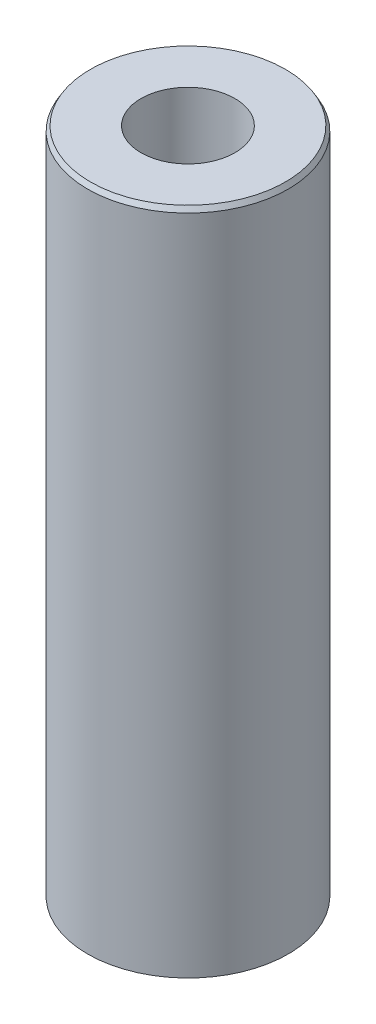
ISO-10303-21;
HEADER;
FILE_DESCRIPTION(('STEP AP214'),'2;1');
FILE_NAME('part.step','',(''),(''),'','','');
FILE_SCHEMA(('AUTOMOTIVE_DESIGN { 1 0 10303 214 1 1 1 1 }'));
ENDSEC;
DATA;
#1=APPLICATION_CONTEXT('core data for automotive mechanical design processes');
#2=APPLICATION_PROTOCOL_DEFINITION('international standard','automotive_design',2000,#1);
#3=PRODUCT_CONTEXT('',#1,'mechanical');
#4=PRODUCT('Part','Part','',(#3));
#5=PRODUCT_RELATED_PRODUCT_CATEGORY('part','',(#4));
#6=PRODUCT_DEFINITION_FORMATION('','',#4);
#7=PRODUCT_DEFINITION_CONTEXT('part definition',#1,'design');
#8=PRODUCT_DEFINITION('design','',#6,#7);
#9=PRODUCT_DEFINITION_SHAPE('','',#8);
#10=(LENGTH_UNIT() NAMED_UNIT(*) SI_UNIT(.MILLI.,.METRE.));
#11=(NAMED_UNIT(*) PLANE_ANGLE_UNIT() SI_UNIT($,.RADIAN.));
#12=(NAMED_UNIT(*) SI_UNIT($,.STERADIAN.) SOLID_ANGLE_UNIT());
#13=UNCERTAINTY_MEASURE_WITH_UNIT(LENGTH_MEASURE(1.E-05),#10,'distance_accuracy_value','');
#14=(GEOMETRIC_REPRESENTATION_CONTEXT(3) GLOBAL_UNCERTAINTY_ASSIGNED_CONTEXT((#13)) GLOBAL_UNIT_ASSIGNED_CONTEXT((#10,
#11,#12)) REPRESENTATION_CONTEXT('',''));
#15=CARTESIAN_POINT('',(0.,0.,0.));
#16=DIRECTION('',(0.,0.,1.));
#17=DIRECTION('',(1.,0.,0.));
#18=AXIS2_PLACEMENT_3D('',#15,#16,#17);
#19=CARTESIAN_POINT('',(0.,250.416213844972,0.));
#20=DIRECTION('',(0.,-1.,0.));
#21=DIRECTION('',(0.,0.,-1.));
#22=AXIS2_PLACEMENT_3D('',#19,#20,#21);
#23=CYLINDRICAL_SURFACE('',#22,37.5);
#24=CARTESIAN_POINT('',(0.,248.614833590709,0.));
#25=DIRECTION('',(0.,1.,0.));
#26=DIRECTION('',(0.,0.,1.));
#27=AXIS2_PLACEMENT_3D('',#24,#25,#26);
#28=CIRCLE('',#27,37.5);
#29=CARTESIAN_POINT('',(0.,248.614833590709,37.5));
#30=VERTEX_POINT('',#29);
#31=EDGE_CURVE('E50',#30,#30,#28,.F.);
#32=ORIENTED_EDGE('',*,*,#31,.T.);
#33=EDGE_LOOP('',(#32));
#34=FACE_BOUND('',#33,.T.);
#35=CARTESIAN_POINT('',(0.,1.04002737471159,0.));
#36=DIRECTION('',(0.,1.,0.));
#37=DIRECTION('',(0.,0.,1.));
#38=AXIS2_PLACEMENT_3D('',#35,#36,#37);
#39=CIRCLE('',#38,37.5);
#40=CARTESIAN_POINT('',(0.,1.04002737471159,37.5));
#41=VERTEX_POINT('',#40);
#42=EDGE_CURVE('E51',#41,#41,#39,.T.);
#43=ORIENTED_EDGE('',*,*,#42,.T.);
#44=EDGE_LOOP('',(#43));
#45=FACE_BOUND('',#44,.T.);
#46=ADVANCED_FACE('F39',(#34,#45),#23,.T.);
#47=CARTESIAN_POINT('',(0.,250.416213844972,0.));
#48=DIRECTION('',(0.,1.,0.));
#49=DIRECTION('',(0.,0.,1.));
#50=AXIS2_PLACEMENT_3D('',#47,#48,#49);
#51=PLANE('',#50);
#52=CARTESIAN_POINT('',(0.,250.416213844972,0.));
#53=DIRECTION('',(0.,1.,0.));
#54=DIRECTION('',(0.,0.,1.));
#55=AXIS2_PLACEMENT_3D('',#52,#53,#54);
#56=CIRCLE('',#55,36.4599726252884);
#57=CARTESIAN_POINT('',(0.,250.416213844972,36.4599726252884));
#58=VERTEX_POINT('',#57);
#59=EDGE_CURVE('E54',#58,#58,#56,.T.);
#60=ORIENTED_EDGE('',*,*,#59,.T.);
#61=EDGE_LOOP('',(#60));
#62=FACE_BOUND('',#61,.T.);
#63=CARTESIAN_POINT('',(0.,250.416213844972,0.));
#64=DIRECTION('',(0.,1.,0.));
#65=DIRECTION('',(0.,0.,1.));
#66=AXIS2_PLACEMENT_3D('',#63,#64,#65);
#67=CIRCLE('',#66,17.5621372865211);
#68=CARTESIAN_POINT('',(0.,250.416213844972,17.5621372865211));
#69=VERTEX_POINT('',#68);
#70=EDGE_CURVE('E58',#69,#69,#67,.T.);
#71=ORIENTED_EDGE('',*,*,#70,.F.);
#72=EDGE_LOOP('',(#71));
#73=FACE_BOUND('',#72,.T.);
#74=ADVANCED_FACE('F69',(#62,#73),#51,.T.);
#75=CARTESIAN_POINT('',(0.,0.,0.));
#76=DIRECTION('',(0.,1.,0.));
#77=DIRECTION('',(0.,0.,1.));
#78=AXIS2_PLACEMENT_3D('',#75,#76,#77);
#79=PLANE('',#78);
#80=CARTESIAN_POINT('',(0.,0.,0.));
#81=DIRECTION('',(0.,1.,0.));
#82=DIRECTION('',(0.,0.,1.));
#83=AXIS2_PLACEMENT_3D('',#80,#81,#82);
#84=CIRCLE('',#83,35.6986197457371);
#85=CARTESIAN_POINT('',(0.,0.,35.6986197457371));
#86=VERTEX_POINT('',#85);
#87=EDGE_CURVE('E10',#86,#86,#84,.F.);
#88=ORIENTED_EDGE('',*,*,#87,.T.);
#89=EDGE_LOOP('',(#88));
#90=FACE_BOUND('',#89,.T.);
#91=CARTESIAN_POINT('',(0.,0.,0.));
#92=DIRECTION('',(0.,1.,0.));
#93=DIRECTION('',(0.,0.,1.));
#94=AXIS2_PLACEMENT_3D('',#91,#92,#93);
#95=CIRCLE('',#94,17.5621372865211);
#96=CARTESIAN_POINT('',(0.,0.,17.5621372865211));
#97=VERTEX_POINT('',#96);
#98=EDGE_CURVE('E63',#97,#97,#95,.T.);
#99=ORIENTED_EDGE('',*,*,#98,.T.);
#100=EDGE_LOOP('',(#99));
#101=FACE_BOUND('',#100,.T.);
#102=ADVANCED_FACE('F75',(#90,#101),#79,.F.);
#103=CARTESIAN_POINT('',(0.,250.416213844972,0.));
#104=DIRECTION('',(0.,-1.,0.));
#105=DIRECTION('',(0.,0.,-1.));
#106=AXIS2_PLACEMENT_3D('',#103,#104,#105);
#107=CYLINDRICAL_SURFACE('',#106,17.5621372865211);
#108=ORIENTED_EDGE('',*,*,#70,.T.);
#109=EDGE_LOOP('',(#108));
#110=FACE_BOUND('',#109,.T.);
#111=ORIENTED_EDGE('',*,*,#98,.F.);
#112=EDGE_LOOP('',(#111));
#113=FACE_BOUND('',#112,.T.);
#114=ADVANCED_FACE('F70',(#110,#113),#107,.F.);
#115=CARTESIAN_POINT('',(0.,250.416213844972,0.));
#116=DIRECTION('',(0.,-1.,0.));
#117=DIRECTION('',(0.,0.,-1.));
#118=AXIS2_PLACEMENT_3D('',#115,#116,#117);
#119=CONICAL_SURFACE('',#118,36.4599726252884,0.523598775598295);
#120=ORIENTED_EDGE('',*,*,#31,.F.);
#121=EDGE_LOOP('',(#120));
#122=FACE_BOUND('',#121,.T.);
#123=ORIENTED_EDGE('',*,*,#59,.F.);
#124=EDGE_LOOP('',(#123));
#125=FACE_BOUND('',#124,.T.);
#126=ADVANCED_FACE('F81',(#122,#125),#119,.T.);
#127=CARTESIAN_POINT('',(0.,1.04002737471159,0.));
#128=DIRECTION('',(0.,1.,0.));
#129=DIRECTION('',(0.,0.,1.));
#130=AXIS2_PLACEMENT_3D('',#127,#128,#129);
#131=CONICAL_SURFACE('',#130,37.5,1.04719755119659);
#132=ORIENTED_EDGE('',*,*,#87,.F.);
#133=EDGE_LOOP('',(#132));
#134=FACE_BOUND('',#133,.T.);
#135=ORIENTED_EDGE('',*,*,#42,.F.);
#136=EDGE_LOOP('',(#135));
#137=FACE_BOUND('',#136,.T.);
#138=ADVANCED_FACE('F45',(#134,#137),#131,.T.);
#139=CLOSED_SHELL('',(#46,#74,#102,#114,#126,#138));
#140=MANIFOLD_SOLID_BREP('B2',#139);
#141=ADVANCED_BREP_SHAPE_REPRESENTATION('',(#18,#140),#14);
#142=SHAPE_DEFINITION_REPRESENTATION(#9,#141);
ENDSEC;
END-ISO-10303-21;
